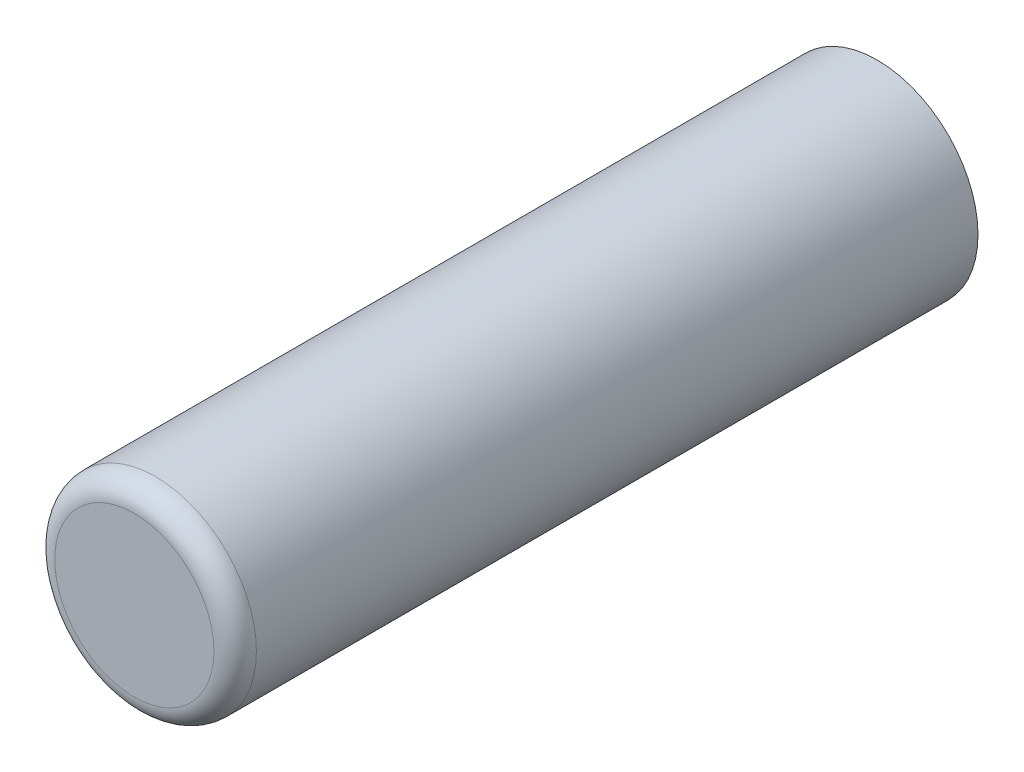
ISO-10303-21;
HEADER;
FILE_DESCRIPTION(('STEP AP214'),'2;1');
FILE_NAME('part.step','',(''),(''),'','','');
FILE_SCHEMA(('AUTOMOTIVE_DESIGN { 1 0 10303 214 1 1 1 1 }'));
ENDSEC;
DATA;
#1=APPLICATION_CONTEXT('core data for automotive mechanical design processes');
#2=APPLICATION_PROTOCOL_DEFINITION('international standard','automotive_design',2000,#1);
#3=PRODUCT_CONTEXT('',#1,'mechanical');
#4=PRODUCT('Part','Part','',(#3));
#5=PRODUCT_RELATED_PRODUCT_CATEGORY('part','',(#4));
#6=PRODUCT_DEFINITION_FORMATION('','',#4);
#7=PRODUCT_DEFINITION_CONTEXT('part definition',#1,'design');
#8=PRODUCT_DEFINITION('design','',#6,#7);
#9=PRODUCT_DEFINITION_SHAPE('','',#8);
#10=(LENGTH_UNIT() NAMED_UNIT(*) SI_UNIT(.MILLI.,.METRE.));
#11=(NAMED_UNIT(*) PLANE_ANGLE_UNIT() SI_UNIT($,.RADIAN.));
#12=(NAMED_UNIT(*) SI_UNIT($,.STERADIAN.) SOLID_ANGLE_UNIT());
#13=UNCERTAINTY_MEASURE_WITH_UNIT(LENGTH_MEASURE(1.E-05),#10,'distance_accuracy_value','');
#14=(GEOMETRIC_REPRESENTATION_CONTEXT(3) GLOBAL_UNCERTAINTY_ASSIGNED_CONTEXT((#13)) GLOBAL_UNIT_ASSIGNED_CONTEXT((#10,
#11,#12)) REPRESENTATION_CONTEXT('',''));
#15=CARTESIAN_POINT('',(0.,0.,0.));
#16=DIRECTION('',(0.,0.,1.));
#17=DIRECTION('',(1.,0.,0.));
#18=AXIS2_PLACEMENT_3D('',#15,#16,#17);
#19=CARTESIAN_POINT('',(0.,0.,14.));
#20=DIRECTION('',(0.,0.,-1.));
#21=DIRECTION('',(-1.,0.,0.));
#22=AXIS2_PLACEMENT_3D('',#19,#20,#21);
#23=CYLINDRICAL_SURFACE('',#22,3.8);
#24=CARTESIAN_POINT('',(0.,0.,13.2));
#25=DIRECTION('',(0.,0.,1.));
#26=DIRECTION('',(1.,0.,0.));
#27=AXIS2_PLACEMENT_3D('',#24,#25,#26);
#28=CIRCLE('',#27,3.8);
#29=CARTESIAN_POINT('',(3.8,0.,13.2));
#30=VERTEX_POINT('',#29);
#31=EDGE_CURVE('E10',#30,#30,#28,.F.);
#32=ORIENTED_EDGE('',*,*,#31,.T.);
#33=EDGE_LOOP('',(#32));
#34=FACE_BOUND('',#33,.T.);
#35=CARTESIAN_POINT('',(0.,0.,-14.));
#36=DIRECTION('',(0.,0.,1.));
#37=DIRECTION('',(1.,0.,0.));
#38=AXIS2_PLACEMENT_3D('',#35,#36,#37);
#39=CIRCLE('',#38,3.8);
#40=CARTESIAN_POINT('',(3.8,0.,-14.));
#41=VERTEX_POINT('',#40);
#42=EDGE_CURVE('E43',#41,#41,#39,.T.);
#43=ORIENTED_EDGE('',*,*,#42,.T.);
#44=EDGE_LOOP('',(#43));
#45=FACE_BOUND('',#44,.T.);
#46=ADVANCED_FACE('F32',(#34,#45),#23,.T.);
#47=CARTESIAN_POINT('',(0.,0.,14.));
#48=DIRECTION('',(0.,0.,1.));
#49=DIRECTION('',(1.,0.,0.));
#50=AXIS2_PLACEMENT_3D('',#47,#48,#49);
#51=PLANE('',#50);
#52=CARTESIAN_POINT('',(0.,0.,14.));
#53=DIRECTION('',(0.,0.,1.));
#54=DIRECTION('',(1.,0.,0.));
#55=AXIS2_PLACEMENT_3D('',#52,#53,#54);
#56=CIRCLE('',#55,3.);
#57=CARTESIAN_POINT('',(3.,0.,14.));
#58=VERTEX_POINT('',#57);
#59=EDGE_CURVE('E39',#58,#58,#56,.T.);
#60=ORIENTED_EDGE('',*,*,#59,.T.);
#61=EDGE_LOOP('',(#60));
#62=FACE_BOUND('',#61,.T.);
#63=ADVANCED_FACE('F53',(#62),#51,.T.);
#64=CARTESIAN_POINT('',(0.,0.,-14.));
#65=DIRECTION('',(0.,0.,1.));
#66=DIRECTION('',(1.,0.,0.));
#67=AXIS2_PLACEMENT_3D('',#64,#65,#66);
#68=PLANE('',#67);
#69=ORIENTED_EDGE('',*,*,#42,.F.);
#70=EDGE_LOOP('',(#69));
#71=FACE_BOUND('',#70,.T.);
#72=ADVANCED_FACE('F51',(#71),#68,.F.);
#73=CARTESIAN_POINT('',(0.,0.,13.2));
#74=DIRECTION('',(0.,0.,1.));
#75=DIRECTION('',(1.,0.,0.));
#76=AXIS2_PLACEMENT_3D('',#73,#74,#75);
#77=TOROIDAL_SURFACE('',#76,3.,0.8);
#78=ORIENTED_EDGE('',*,*,#31,.F.);
#79=EDGE_LOOP('',(#78));
#80=FACE_BOUND('',#79,.T.);
#81=ORIENTED_EDGE('',*,*,#59,.F.);
#82=EDGE_LOOP('',(#81));
#83=FACE_BOUND('',#82,.T.);
#84=ADVANCED_FACE('F34',(#80,#83),#77,.T.);
#85=CLOSED_SHELL('',(#46,#63,#72,#84));
#86=MANIFOLD_SOLID_BREP('B2',#85);
#87=ADVANCED_BREP_SHAPE_REPRESENTATION('',(#18,#86),#14);
#88=SHAPE_DEFINITION_REPRESENTATION(#9,#87);
ENDSEC;
END-ISO-10303-21;
